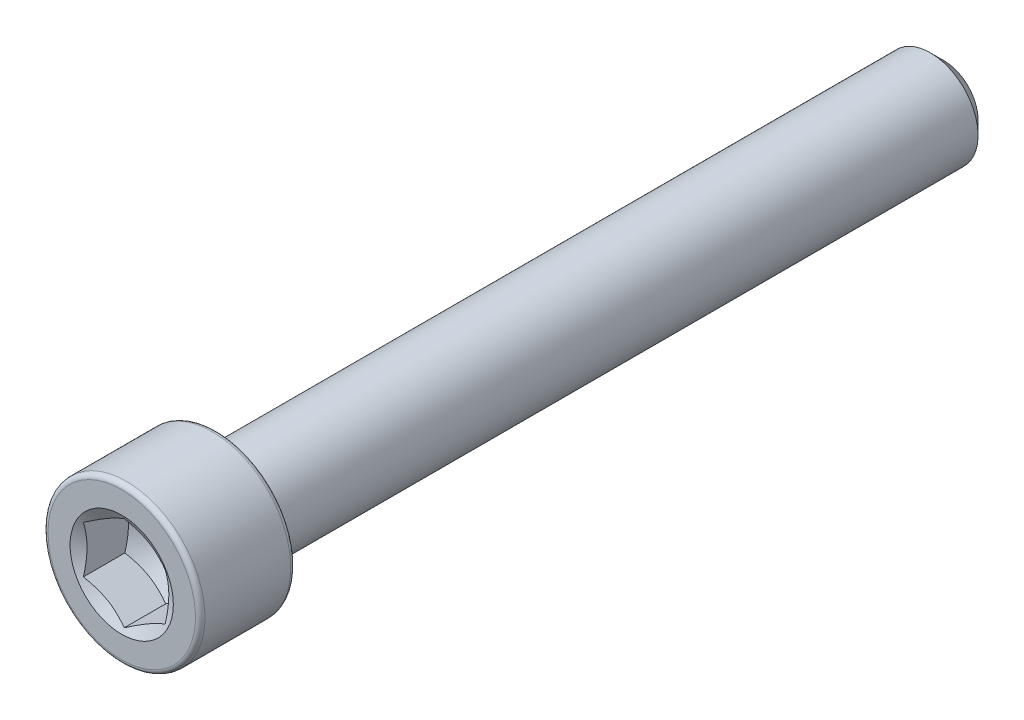
ISO-10303-21;
HEADER;
FILE_DESCRIPTION(('STEP AP214'),'2;1');
FILE_NAME('part.step','',(''),(''),'','','');
FILE_SCHEMA(('AUTOMOTIVE_DESIGN { 1 0 10303 214 1 1 1 1 }'));
ENDSEC;
DATA;
#1=APPLICATION_CONTEXT('core data for automotive mechanical design processes');
#2=APPLICATION_PROTOCOL_DEFINITION('international standard','automotive_design',2000,#1);
#3=PRODUCT_CONTEXT('',#1,'mechanical');
#4=PRODUCT('Part','Part','',(#3));
#5=PRODUCT_RELATED_PRODUCT_CATEGORY('part','',(#4));
#6=PRODUCT_DEFINITION_FORMATION('','',#4);
#7=PRODUCT_DEFINITION_CONTEXT('part definition',#1,'design');
#8=PRODUCT_DEFINITION('design','',#6,#7);
#9=PRODUCT_DEFINITION_SHAPE('','',#8);
#10=(LENGTH_UNIT() NAMED_UNIT(*) SI_UNIT(.MILLI.,.METRE.));
#11=(NAMED_UNIT(*) PLANE_ANGLE_UNIT() SI_UNIT($,.RADIAN.));
#12=(NAMED_UNIT(*) SI_UNIT($,.STERADIAN.) SOLID_ANGLE_UNIT());
#13=UNCERTAINTY_MEASURE_WITH_UNIT(LENGTH_MEASURE(1.E-05),#10,'distance_accuracy_value','');
#14=(GEOMETRIC_REPRESENTATION_CONTEXT(3) GLOBAL_UNCERTAINTY_ASSIGNED_CONTEXT((#13)) GLOBAL_UNIT_ASSIGNED_CONTEXT((#10,
#11,#12)) REPRESENTATION_CONTEXT('',''));
#15=CARTESIAN_POINT('',(0.,0.,0.));
#16=DIRECTION('',(0.,0.,1.));
#17=DIRECTION('',(1.,0.,0.));
#18=AXIS2_PLACEMENT_3D('',#15,#16,#17);
#19=CARTESIAN_POINT('',(0.,0.,-17.9578));
#20=DIRECTION('',(0.,0.,-1.));
#21=DIRECTION('',(-1.,0.,0.));
#22=AXIS2_PLACEMENT_3D('',#19,#20,#21);
#23=PLANE('',#22);
#24=CARTESIAN_POINT('',(0.,0.,-17.9578));
#25=DIRECTION('',(0.,0.,-1.));
#26=DIRECTION('',(-1.,0.,0.));
#27=AXIS2_PLACEMENT_3D('',#24,#25,#26);
#28=CIRCLE('',#27,1.48748750000003);
#29=CARTESIAN_POINT('',(-1.48748750000003,0.,-17.9578));
#30=VERTEX_POINT('',#29);
#31=EDGE_CURVE('E57',#30,#30,#28,.T.);
#32=ORIENTED_EDGE('',*,*,#31,.T.);
#33=EDGE_LOOP('',(#32));
#34=FACE_BOUND('',#33,.T.);
#35=ADVANCED_FACE('F43',(#34),#23,.T.);
#36=CARTESIAN_POINT('',(0.,0.,-17.9578));
#37=DIRECTION('',(0.,0.,1.));
#38=DIRECTION('',(1.,0.,0.));
#39=AXIS2_PLACEMENT_3D('',#36,#37,#38);
#40=CONICAL_SURFACE('',#39,1.48748750000003,0.785398163397443);
#41=CARTESIAN_POINT('',(0.,0.,-17.3624875));
#42=DIRECTION('',(0.,0.,-1.));
#43=DIRECTION('',(-1.,0.,0.));
#44=AXIS2_PLACEMENT_3D('',#41,#42,#43);
#45=CIRCLE('',#44,2.08280000000002);
#46=CARTESIAN_POINT('',(-2.08280000000002,0.,-17.3624875));
#47=VERTEX_POINT('',#46);
#48=EDGE_CURVE('E252',#47,#47,#45,.T.);
#49=ORIENTED_EDGE('',*,*,#48,.T.);
#50=EDGE_LOOP('',(#49));
#51=FACE_BOUND('',#50,.T.);
#52=ORIENTED_EDGE('',*,*,#31,.F.);
#53=EDGE_LOOP('',(#52));
#54=FACE_BOUND('',#53,.T.);
#55=ADVANCED_FACE('F241',(#51,#54),#40,.T.);
#56=CARTESIAN_POINT('',(0.,0.,-17.9578));
#57=DIRECTION('',(0.,0.,-1.));
#58=DIRECTION('',(-1.,0.,0.));
#59=AXIS2_PLACEMENT_3D('',#56,#57,#58);
#60=CYLINDRICAL_SURFACE('',#59,2.08280000000002);
#61=CARTESIAN_POINT('',(0.,0.,13.7922));
#62=DIRECTION('',(0.,0.,-1.));
#63=DIRECTION('',(-1.,0.,0.));
#64=AXIS2_PLACEMENT_3D('',#61,#62,#63);
#65=CIRCLE('',#64,2.08280000000002);
#66=CARTESIAN_POINT('',(-2.08280000000002,0.,13.7922));
#67=VERTEX_POINT('',#66);
#68=EDGE_CURVE('E255',#67,#67,#65,.T.);
#69=ORIENTED_EDGE('',*,*,#68,.T.);
#70=EDGE_LOOP('',(#69));
#71=FACE_BOUND('',#70,.T.);
#72=ORIENTED_EDGE('',*,*,#48,.F.);
#73=EDGE_LOOP('',(#72));
#74=FACE_BOUND('',#73,.T.);
#75=ADVANCED_FACE('F246',(#71,#74),#60,.T.);
#76=CARTESIAN_POINT('',(0.,2.08280000000001,13.7922));
#77=DIRECTION('',(0.,0.,-1.));
#78=DIRECTION('',(-1.,0.,0.));
#79=AXIS2_PLACEMENT_3D('',#76,#77,#78);
#80=PLANE('',#79);
#81=CARTESIAN_POINT('',(0.,0.,13.7922));
#82=DIRECTION('',(0.,0.,-1.));
#83=DIRECTION('',(-1.,0.,0.));
#84=AXIS2_PLACEMENT_3D('',#81,#82,#83);
#85=CIRCLE('',#84,3.22072);
#86=CARTESIAN_POINT('',(-3.22072,0.,13.7922));
#87=VERTEX_POINT('',#86);
#88=EDGE_CURVE('E261',#87,#87,#85,.T.);
#89=ORIENTED_EDGE('',*,*,#88,.T.);
#90=EDGE_LOOP('',(#89));
#91=FACE_BOUND('',#90,.T.);
#92=ORIENTED_EDGE('',*,*,#68,.F.);
#93=EDGE_LOOP('',(#92));
#94=FACE_BOUND('',#93,.T.);
#95=ADVANCED_FACE('F359',(#91,#94),#80,.T.);
#96=CARTESIAN_POINT('',(0.,0.,14.00048));
#97=DIRECTION('',(0.,0.,-1.));
#98=DIRECTION('',(-1.,0.,0.));
#99=AXIS2_PLACEMENT_3D('',#96,#97,#98);
#100=TOROIDAL_SURFACE('',#99,3.22072,0.208279999999999);
#101=CARTESIAN_POINT('',(0.,0.,14.00048));
#102=DIRECTION('',(0.,0.,-1.));
#103=DIRECTION('',(-1.,0.,0.));
#104=AXIS2_PLACEMENT_3D('',#101,#102,#103);
#105=CIRCLE('',#104,3.429);
#106=CARTESIAN_POINT('',(-3.429,0.,14.00048));
#107=VERTEX_POINT('',#106);
#108=EDGE_CURVE('E265',#107,#107,#105,.T.);
#109=ORIENTED_EDGE('',*,*,#108,.T.);
#110=EDGE_LOOP('',(#109));
#111=FACE_BOUND('',#110,.T.);
#112=ORIENTED_EDGE('',*,*,#88,.F.);
#113=EDGE_LOOP('',(#112));
#114=FACE_BOUND('',#113,.T.);
#115=ADVANCED_FACE('F352',(#111,#114),#100,.T.);
#116=CARTESIAN_POINT('',(0.,0.,-17.9578));
#117=DIRECTION('',(0.,0.,-1.));
#118=DIRECTION('',(-1.,0.,0.));
#119=AXIS2_PLACEMENT_3D('',#116,#117,#118);
#120=CYLINDRICAL_SURFACE('',#119,3.429);
#121=CARTESIAN_POINT('',(0.,0.,17.74952));
#122=DIRECTION('',(0.,0.,-1.));
#123=DIRECTION('',(-1.,0.,0.));
#124=AXIS2_PLACEMENT_3D('',#121,#122,#123);
#125=CIRCLE('',#124,3.429);
#126=CARTESIAN_POINT('',(-3.429,0.,17.74952));
#127=VERTEX_POINT('',#126);
#128=EDGE_CURVE('E268',#127,#127,#125,.T.);
#129=ORIENTED_EDGE('',*,*,#128,.T.);
#130=EDGE_LOOP('',(#129));
#131=FACE_BOUND('',#130,.T.);
#132=ORIENTED_EDGE('',*,*,#108,.F.);
#133=EDGE_LOOP('',(#132));
#134=FACE_BOUND('',#133,.T.);
#135=ADVANCED_FACE('F287',(#131,#134),#120,.T.);
#136=CARTESIAN_POINT('',(0.,0.,17.74952));
#137=DIRECTION('',(0.,0.,-1.));
#138=DIRECTION('',(-1.,0.,0.));
#139=AXIS2_PLACEMENT_3D('',#136,#137,#138);
#140=TOROIDAL_SURFACE('',#139,3.22072,0.208280000000003);
#141=CARTESIAN_POINT('',(0.,0.,17.9578));
#142=DIRECTION('',(0.,0.,-1.));
#143=DIRECTION('',(-1.,0.,0.));
#144=AXIS2_PLACEMENT_3D('',#141,#142,#143);
#145=CIRCLE('',#144,3.22072);
#146=CARTESIAN_POINT('',(-3.22072,0.,17.9578));
#147=VERTEX_POINT('',#146);
#148=EDGE_CURVE('E135',#147,#147,#145,.T.);
#149=ORIENTED_EDGE('',*,*,#148,.T.);
#150=EDGE_LOOP('',(#149));
#151=FACE_BOUND('',#150,.T.);
#152=ORIENTED_EDGE('',*,*,#128,.F.);
#153=EDGE_LOOP('',(#152));
#154=FACE_BOUND('',#153,.T.);
#155=ADVANCED_FACE('F277',(#151,#154),#140,.T.);
#156=CARTESIAN_POINT('',(0.,3.22071999999999,17.9578));
#157=DIRECTION('',(0.,0.,1.));
#158=DIRECTION('',(1.,0.,0.));
#159=AXIS2_PLACEMENT_3D('',#156,#157,#158);
#160=PLANE('',#159);
#161=CARTESIAN_POINT('',(0.,0.,17.9578));
#162=DIRECTION('',(0.,0.,1.));
#163=DIRECTION('',(1.,0.,0.));
#164=AXIS2_PLACEMENT_3D('',#161,#162,#163);
#165=CIRCLE('',#164,2.2553058273014);
#166=CARTESIAN_POINT('',(2.2553058273014,0.,17.9578));
#167=VERTEX_POINT('',#166);
#168=EDGE_CURVE('E290',#167,#167,#165,.T.);
#169=ORIENTED_EDGE('',*,*,#168,.F.);
#170=EDGE_LOOP('',(#169));
#171=FACE_BOUND('',#170,.T.);
#172=ORIENTED_EDGE('',*,*,#148,.F.);
#173=EDGE_LOOP('',(#172));
#174=FACE_BOUND('',#173,.T.);
#175=ADVANCED_FACE('F146',(#171,#174),#160,.T.);
#176=CARTESIAN_POINT('',(0.,0.,17.9578));
#177=DIRECTION('',(0.,0.,1.));
#178=DIRECTION('',(1.,0.,0.));
#179=AXIS2_PLACEMENT_3D('',#176,#177,#178);
#180=CONICAL_SURFACE('',#179,2.2553058273014,1.0471975511966);
#181=ORIENTED_EDGE('',*,*,#168,.T.);
#182=EDGE_LOOP('',(#181));
#183=FACE_BOUND('',#182,.T.);
#184=CARTESIAN_POINT('',(1.78613749999999,1.030996026327,17.8463902457682));
#185=CARTESIAN_POINT('',(1.70765298753213,1.07630908072754,17.8202168076921));
#186=CARTESIAN_POINT('',(1.62849100532971,1.12201327246169,17.7964125992998));
#187=CARTESIAN_POINT('',(1.46879612904911,1.2142131522705,17.7548611490479));
#188=CARTESIAN_POINT('',(1.38826039638754,1.26071047920204,17.7371286082323));
#189=CARTESIAN_POINT('',(1.22818707140352,1.35312885647164,17.7095240038494));
#190=CARTESIAN_POINT('',(1.14867411525882,1.39903568310585,17.699468239448));
#191=CARTESIAN_POINT('',(0.989273866724129,1.49106545950624,17.6874614604738));
#192=CARTESIAN_POINT('',(0.909387154117847,1.53718807453415,17.6855005056729));
#193=CARTESIAN_POINT('',(0.760101040798418,1.6233784522454,17.6895693606205));
#194=CARTESIAN_POINT('',(0.690679347730417,1.66345908542581,17.6946001252606));
#195=CARTESIAN_POINT('',(0.552288266102523,1.74335921365712,17.7105479939992));
#196=CARTESIAN_POINT('',(0.483319356586402,1.78317843213197,17.721470551437));
#197=CARTESIAN_POINT('',(0.344642695770659,1.86324343958425,17.7487773973743));
#198=CARTESIAN_POINT('',(0.27495250563971,1.90347908961623,17.7652774949854));
#199=CARTESIAN_POINT('',(0.13661183024592,1.98335011579471,17.8027267258336));
#200=CARTESIAN_POINT('',(0.0679595711845169,2.02298651604429,17.8236670537832));
#201=CARTESIAN_POINT('',(-0.000200000000001078,2.06233846281552,17.8463902457682));
#202=B_SPLINE_CURVE_WITH_KNOTS('',3,(#184,#185,#186,#187,#188,#189,#190,#191,#192,#193,#194,
#195,#196,#197,#198,#199,#200,#201),.UNSPECIFIED.,.F.,.F.,(4,2,2,2,2,2,2,2,4),(0.,
0.283101204842063,0.56688310088833,0.843640732082936,1.12005841039328,1.36078612471159,
1.60173703564045,1.84803423693753,2.0938475066861),.UNSPECIFIED.);
#203=CARTESIAN_POINT('',(1.78593749999999,1.03111149638084,17.8463235735026));
#204=VERTEX_POINT('',#203);
#205=CARTESIAN_POINT('',(0.,2.06222299276168,17.8463235735026));
#206=VERTEX_POINT('',#205);
#207=EDGE_CURVE('E115',#204,#206,#202,.T.);
#208=ORIENTED_EDGE('',*,*,#207,.F.);
#209=CARTESIAN_POINT('',(1.78593749999999,-2.69758264771828,18.5235426868391));
#210=CARTESIAN_POINT('',(1.78593749999999,-2.62012259041519,18.4862636843077));
#211=CARTESIAN_POINT('',(1.78593749999999,-2.54247668483849,18.4493637946794));
#212=CARTESIAN_POINT('',(1.78593749999999,-2.38671397459031,18.3765371845213));
#213=CARTESIAN_POINT('',(1.78593749999999,-2.30859709065796,18.3406106337188));
#214=CARTESIAN_POINT('',(1.78593749999999,-2.15135521009003,18.2697492558914));
#215=CARTESIAN_POINT('',(1.78593749999999,-2.07222698237029,18.2348215722438));
#216=CARTESIAN_POINT('',(1.78593749999999,-1.91331493598689,18.1664965769099));
#217=CARTESIAN_POINT('',(1.78593749999999,-1.83353115094794,18.1330991873029));
#218=CARTESIAN_POINT('',(1.78593749999999,-1.67096618357135,18.0673456687277));
#219=CARTESIAN_POINT('',(1.78593749999999,-1.58816300038914,18.0350436191632));
#220=CARTESIAN_POINT('',(1.78593749999999,-1.42156112656087,17.9730632721621));
#221=CARTESIAN_POINT('',(1.78593749999999,-1.33776231333349,17.9433853016785));
#222=CARTESIAN_POINT('',(1.78593749999999,-1.1692220220391,17.8874867539738));
#223=CARTESIAN_POINT('',(1.78593749999999,-1.084483165363,17.8612583568392));
#224=CARTESIAN_POINT('',(1.78593749999999,-0.913786163547337,17.8131433270575));
#225=CARTESIAN_POINT('',(1.78593749999999,-0.827828324781463,17.7912556234588));
#226=CARTESIAN_POINT('',(1.78593749999999,-0.655084549884429,17.7530261588678));
#227=CARTESIAN_POINT('',(1.78593749999999,-0.568304335338395,17.7366590421217));
#228=CARTESIAN_POINT('',(1.78593749999999,-0.393746048068966,17.7104528135952));
#229=CARTESIAN_POINT('',(1.78593749999999,-0.305968052538008,17.7006132002697));
#230=CARTESIAN_POINT('',(1.78593749999999,-0.130962716485576,17.6883785557359));
#231=CARTESIAN_POINT('',(1.78593749999999,-0.0437418469765707,17.6858936055758));
#232=CARTESIAN_POINT('',(1.78593749999999,0.130592934900126,17.688336070232));
#233=CARTESIAN_POINT('',(1.78593749999999,0.217706841000561,17.693263900411));
#234=CARTESIAN_POINT('',(1.78593749999999,0.431120733446831,17.7139821974728));
#235=CARTESIAN_POINT('',(1.78593749999999,0.557038517233457,17.7337228004352));
#236=CARTESIAN_POINT('',(1.78593749999999,0.806440222774731,17.7850381632509));
#237=CARTESIAN_POINT('',(1.78593749999999,0.929921492877504,17.8166251403235));
#238=CARTESIAN_POINT('',(1.78593749999999,1.1771275779522,17.8890666470735));
#239=CARTESIAN_POINT('',(1.78593749999999,1.30079401125151,17.9301156843391));
#240=CARTESIAN_POINT('',(1.78593749999999,1.48458504652945,17.9962570287602));
#241=CARTESIAN_POINT('',(1.78593749999999,1.54555601200979,18.0190621265715));
#242=CARTESIAN_POINT('',(1.78593749999999,1.66700448583618,18.0659509496154));
#243=CARTESIAN_POINT('',(1.78593749999999,1.72748200297302,18.0900346520121));
#244=CARTESIAN_POINT('',(1.78593749999999,1.88424149051046,18.1540616553898));
#245=CARTESIAN_POINT('',(1.78593749999999,1.98018443802618,18.1948329191166));
#246=CARTESIAN_POINT('',(1.78593749999999,2.17117609670512,18.2784247196407));
#247=CARTESIAN_POINT('',(1.78593749999999,2.26622473668082,18.3212454179505));
#248=CARTESIAN_POINT('',(1.78593749999999,2.55034675834729,18.4520525004115));
#249=CARTESIAN_POINT('',(1.78593749999999,2.73834755541704,18.5423633596409));
#250=CARTESIAN_POINT('',(1.78593749999999,3.11271398702262,18.7268619991649));
#251=CARTESIAN_POINT('',(1.78593749999999,3.29907721105925,18.8210546102587));
#252=CARTESIAN_POINT('',(1.78593749999999,3.67050227471046,19.0118957072539));
#253=CARTESIAN_POINT('',(1.78593749999999,3.85556431392613,19.1085438055063));
#254=CARTESIAN_POINT('',(1.78593749999999,4.20682233829504,19.29403234663));
#255=CARTESIAN_POINT('',(1.78593749999999,4.37310096820637,19.382716846137));
#256=CARTESIAN_POINT('',(1.78593749999999,4.7051230548909,19.5610996279771));
#257=CARTESIAN_POINT('',(1.78593749999999,4.87086648642207,19.6507979572539));
#258=CARTESIAN_POINT('',(1.78593749999999,5.20149434658739,19.8307084214208));
#259=CARTESIAN_POINT('',(1.78593749999999,5.36637988633187,19.920918517152));
#260=CARTESIAN_POINT('',(1.78593749999999,5.69581647813696,20.1019235664943));
#261=CARTESIAN_POINT('',(1.78593749999999,5.86036755026333,20.1927184835707));
#262=CARTESIAN_POINT('',(1.78593749999999,6.02479942172327,20.2837274610164));
#263=B_SPLINE_CURVE_WITH_KNOTS('',3,(#209,#210,#211,#212,#213,#214,#215,#216,#217,#218,#219,
#220,#221,#222,#223,#224,#225,#226,#227,#228,#229,#230,#231,#232,#233,#234,#235,#236,#237,#238,
#239,#240,#241,#242,#243,#244,#245,#246,#247,#248,#249,#250,#251,#252,#253,#254,#255,#256,#257,
#258,#259,#260,#261,#262),.UNSPECIFIED.,.F.,.F.,(4,2,2,2,2,2,2,2,2,2,2,2,2,2,2,2,2,2,2,2,2,2,2,
2,2,2,4),(0.,0.257895100869512,0.515834886822402,0.775304092310052,1.03476007121657,
1.30136802092372,1.56800914256977,1.83403498977158,2.09999512023696,2.36471652541159,
2.62941758818123,2.89086873629833,3.15233453493419,3.53391158235072,3.91588323889407,
4.30654567753013,4.50182529543225,4.69710142679917,5.00980707595597,5.3225374096282,
5.94815647890531,6.57457913899202,7.20090351250651,7.76625052018438,8.33162381337449,
8.89547174137727,9.45928478023966),.UNSPECIFIED.);
#264=CARTESIAN_POINT('',(1.78593749999999,-1.03111149638084,17.8463235735026));
#265=VERTEX_POINT('',#264);
#266=EDGE_CURVE('E202',#265,#204,#263,.T.);
#267=ORIENTED_EDGE('',*,*,#266,.F.);
#268=CARTESIAN_POINT('',(-0.000200000000002484,-2.06233846281552,17.8463902457682));
#269=CARTESIAN_POINT('',(0.0782845124678554,-2.01702540841499,17.8202168076921));
#270=CARTESIAN_POINT('',(0.157446494670273,-1.97132121668084,17.7964125992998));
#271=CARTESIAN_POINT('',(0.317141370950875,-1.87912133687203,17.7548611490479));
#272=CARTESIAN_POINT('',(0.397677103612452,-1.83262400994048,17.7371286082323));
#273=CARTESIAN_POINT('',(0.557750428596469,-1.74020563267088,17.7095240038494));
#274=CARTESIAN_POINT('',(0.637263384741167,-1.69429880603668,17.699468239448));
#275=CARTESIAN_POINT('',(0.796663633275858,-1.60226902963628,17.6874614604738));
#276=CARTESIAN_POINT('',(0.876550345882141,-1.55614641460837,17.6855005056729));
#277=CARTESIAN_POINT('',(1.02583645920157,-1.46995603689712,17.6895693606205));
#278=CARTESIAN_POINT('',(1.09525815226957,-1.42987540371671,17.6946001252606));
#279=CARTESIAN_POINT('',(1.23364923389746,-1.34997527548541,17.7105479939992));
#280=CARTESIAN_POINT('',(1.30261814341359,-1.31015605701056,17.721470551437));
#281=CARTESIAN_POINT('',(1.44129480422933,-1.23009104955827,17.7487773973743));
#282=CARTESIAN_POINT('',(1.51098499436028,-1.18985539952629,17.7652774949854));
#283=CARTESIAN_POINT('',(1.64932566975407,-1.10998437334781,17.8027267258336));
#284=CARTESIAN_POINT('',(1.71797792881547,-1.07034797309823,17.8236670537832));
#285=CARTESIAN_POINT('',(1.78613749999999,-1.030996026327,17.8463902457682));
#286=B_SPLINE_CURVE_WITH_KNOTS('',3,(#268,#269,#270,#271,#272,#273,#274,#275,#276,#277,#278,
#279,#280,#281,#282,#283,#284,#285),.UNSPECIFIED.,.F.,.F.,(4,2,2,2,2,2,2,2,4),(0.,
0.283101204842065,0.566883100888332,0.843640732082938,1.12005841039328,1.3607861247116,
1.60173703564045,1.84803423693753,2.0938475066861),.UNSPECIFIED.);
#287=CARTESIAN_POINT('',(0.,-2.06222299276168,17.8463235735026));
#288=VERTEX_POINT('',#287);
#289=EDGE_CURVE('E214',#288,#265,#286,.T.);
#290=ORIENTED_EDGE('',*,*,#289,.F.);
#291=CARTESIAN_POINT('',(-1.78613749999999,-1.030996026327,17.8463902457682));
#292=CARTESIAN_POINT('',(-1.70765298753213,-1.07630908072754,17.8202168076921));
#293=CARTESIAN_POINT('',(-1.62849100532971,-1.12201327246169,17.7964125992998));
#294=CARTESIAN_POINT('',(-1.46879612904911,-1.2142131522705,17.7548611490479));
#295=CARTESIAN_POINT('',(-1.38826039638753,-1.26071047920204,17.7371286082323));
#296=CARTESIAN_POINT('',(-1.22818707140352,-1.35312885647165,17.7095240038494));
#297=CARTESIAN_POINT('',(-1.14867411525882,-1.39903568310585,17.699468239448));
#298=CARTESIAN_POINT('',(-0.989273866724128,-1.49106545950625,17.6874614604738));
#299=CARTESIAN_POINT('',(-0.909387154117845,-1.53718807453416,17.6855005056729));
#300=CARTESIAN_POINT('',(-0.760101040798416,-1.6233784522454,17.6895693606205));
#301=CARTESIAN_POINT('',(-0.690679347730416,-1.66345908542581,17.6946001252606));
#302=CARTESIAN_POINT('',(-0.552288266102523,-1.74335921365712,17.7105479939992));
#303=CARTESIAN_POINT('',(-0.483319356586402,-1.78317843213197,17.7214705514371));
#304=CARTESIAN_POINT('',(-0.34464269577066,-1.86324343958425,17.7487773973743));
#305=CARTESIAN_POINT('',(-0.274952505639711,-1.90347908961623,17.7652774949854));
#306=CARTESIAN_POINT('',(-0.136611830245921,-1.98335011579471,17.8027267258336));
#307=CARTESIAN_POINT('',(-0.067959571184519,-2.02298651604429,17.8236670537832));
#308=CARTESIAN_POINT('',(0.000199999999998103,-2.06233846281552,17.8463902457682));
#309=B_SPLINE_CURVE_WITH_KNOTS('',3,(#291,#292,#293,#294,#295,#296,#297,#298,#299,#300,#301,
#302,#303,#304,#305,#306,#307,#308),.UNSPECIFIED.,.F.,.F.,(4,2,2,2,2,2,2,2,4),(0.,
0.283101204842065,0.566883100888333,0.843640732082938,1.12005841039329,1.3607861247116,
1.60173703564045,1.84803423693753,2.0938475066861),.UNSPECIFIED.);
#310=CARTESIAN_POINT('',(-1.78593749999999,-1.03111149638084,17.8463235735026));
#311=VERTEX_POINT('',#310);
#312=EDGE_CURVE('E64',#311,#288,#309,.T.);
#313=ORIENTED_EDGE('',*,*,#312,.F.);
#314=CARTESIAN_POINT('',(-1.78593749999999,-2.69758264785988,18.5235426869072));
#315=CARTESIAN_POINT('',(-1.78593749999999,-2.62012259055204,18.486263684373));
#316=CARTESIAN_POINT('',(-1.78593749999999,-2.54247668497059,18.4493637947418));
#317=CARTESIAN_POINT('',(-1.78593749999999,-2.38671397471288,18.3765371845779));
#318=CARTESIAN_POINT('',(-1.78593749999999,-2.30859709077576,18.3406106337726));
#319=CARTESIAN_POINT('',(-1.78593749999999,-2.15135521019821,18.2697492559394));
#320=CARTESIAN_POINT('',(-1.78593749999999,-2.07222698247362,18.234821572289));
#321=CARTESIAN_POINT('',(-1.78593749999999,-1.91331493608047,18.1664965769494));
#322=CARTESIAN_POINT('',(-1.78593749999999,-1.83353115103663,18.1330991873395));
#323=CARTESIAN_POINT('',(-1.78593749999999,-1.67096618364998,18.0673456687587));
#324=CARTESIAN_POINT('',(-1.78593749999999,-1.58816300046259,18.0350436191914));
#325=CARTESIAN_POINT('',(-1.78593749999999,-1.42156112662388,17.9730632721847));
#326=CARTESIAN_POINT('',(-1.78593749999999,-1.33776231339123,17.9433853016984));
#327=CARTESIAN_POINT('',(-1.78593749999999,-1.16922202208622,17.8874867539887));
#328=CARTESIAN_POINT('',(-1.78593749999999,-1.08448316540475,17.8612583568517));
#329=CARTESIAN_POINT('',(-1.78593749999999,-0.913786163578209,17.8131433270655));
#330=CARTESIAN_POINT('',(-1.78593749999999,-0.82782832480682,17.7912556234648));
#331=CARTESIAN_POINT('',(-1.78593749999999,-0.655084549895724,17.7530261588699));
#332=CARTESIAN_POINT('',(-1.78593749999999,-0.568304335341104,17.7366590421219));
#333=CARTESIAN_POINT('',(-1.78593749999999,-0.393746048054319,17.7104528135931));
#334=CARTESIAN_POINT('',(-1.78593749999999,-0.305968052514591,17.7006132002672));
#335=CARTESIAN_POINT('',(-1.78593749999999,-0.130962716444772,17.6883785557339));
#336=CARTESIAN_POINT('',(-1.78593749999999,-0.0437418469271504,17.6858936055749));
#337=CARTESIAN_POINT('',(-1.78593749999999,0.130592934966621,17.6883360702346));
#338=CARTESIAN_POINT('',(-1.78593749999999,0.217706841075515,17.693263900416));
#339=CARTESIAN_POINT('',(-1.78593749999999,0.431120733535379,17.7139821974846));
#340=CARTESIAN_POINT('',(-1.78593749999999,0.557038517327045,17.7337228004512));
#341=CARTESIAN_POINT('',(-1.78593749999999,0.806440222878063,17.7850381632754));
#342=CARTESIAN_POINT('',(-1.78593749999999,0.92992149298554,17.8166251403524));
#343=CARTESIAN_POINT('',(-1.78593749999999,1.1771275780697,17.8890666471109));
#344=CARTESIAN_POINT('',(-1.78593749999999,1.30079401137375,17.9301156843806));
#345=CARTESIAN_POINT('',(-1.78593749999999,1.4845850466588,17.9962570288079));
#346=CARTESIAN_POINT('',(-1.78593749999999,1.54555601214149,18.0190621266212));
#347=CARTESIAN_POINT('',(-1.78593749999999,1.66700448597261,18.0659509496691));
#348=CARTESIAN_POINT('',(-1.78593749999999,1.7274820031118,18.0900346520678));
#349=CARTESIAN_POINT('',(-1.78593749999999,1.88424149065075,18.1540616554487));
#350=CARTESIAN_POINT('',(-1.78593749999999,1.98018443816569,18.1948329191765));
#351=CARTESIAN_POINT('',(-1.78593749999999,2.17117609684315,18.2784247197023));
#352=CARTESIAN_POINT('',(-1.78593749999999,2.26622473681816,18.3212454180128));
#353=CARTESIAN_POINT('',(-1.78593749999999,2.55034675848266,18.4520525004756));
#354=CARTESIAN_POINT('',(-1.78593749999999,2.73834755555126,18.5423633597059));
#355=CARTESIAN_POINT('',(-1.78593749999999,3.11271398715466,18.7268619992311));
#356=CARTESIAN_POINT('',(-1.78593749999999,3.29907721119027,18.8210546103253));
#357=CARTESIAN_POINT('',(-1.78593749999999,3.67050227483957,19.0118957073209));
#358=CARTESIAN_POINT('',(-1.78593749999999,3.85556431405435,19.1085438055735));
#359=CARTESIAN_POINT('',(-1.78593749999999,4.20682233842245,19.2940323466977));
#360=CARTESIAN_POINT('',(-1.78593749999999,4.37310096833385,19.3827168462052));
#361=CARTESIAN_POINT('',(-1.78593749999999,4.70512305501857,19.5610996280461));
#362=CARTESIAN_POINT('',(-1.78593749999999,4.87086648654985,19.6507979573232));
#363=CARTESIAN_POINT('',(-1.78593749999999,5.20149434671552,19.8307084214908));
#364=CARTESIAN_POINT('',(-1.78593749999999,5.36637988646023,19.9209185172224));
#365=CARTESIAN_POINT('',(-1.78593749999999,5.69581647826582,20.1019235665653));
#366=CARTESIAN_POINT('',(-1.78593749999999,5.86036755039245,20.192718483642));
#367=CARTESIAN_POINT('',(-1.78593749999999,6.02479942185266,20.283727461088));
#368=B_SPLINE_CURVE_WITH_KNOTS('',3,(#314,#315,#316,#317,#318,#319,#320,#321,#322,#323,#324,
#325,#326,#327,#328,#329,#330,#331,#332,#333,#334,#335,#336,#337,#338,#339,#340,#341,#342,#343,
#344,#345,#346,#347,#348,#349,#350,#351,#352,#353,#354,#355,#356,#357,#358,#359,#360,#361,#362,
#363,#364,#365,#366,#367),.UNSPECIFIED.,.F.,.F.,(4,2,2,2,2,2,2,2,2,2,2,2,2,2,2,2,2,2,2,2,2,2,2,
2,2,2,4),(0.,0.257895100886104,0.51583488685559,0.775304092360041,1.03476007128336,
1.30136802100807,1.5680091426717,1.83403498989101,2.09999512037388,2.36471652557476,
2.62941758837063,2.89086873651338,3.15233453517491,3.5339115826083,3.91588323916855,
4.30654567782215,4.50182529573303,4.69710142710871,5.00980707626452,5.32253740993575,
5.94815647921083,6.57457913929533,7.20090351280763,7.76625052048629,8.33162381367719,
8.8954717416811,9.45928478054463),.UNSPECIFIED.);
#369=CARTESIAN_POINT('',(-1.78593749999999,1.03111149638084,17.8463235735026));
#370=VERTEX_POINT('',#369);
#371=EDGE_CURVE('E11',#370,#311,#368,.F.);
#372=ORIENTED_EDGE('',*,*,#371,.F.);
#373=CARTESIAN_POINT('',(0.000199999999998483,2.06233846281552,17.8463902457682));
#374=CARTESIAN_POINT('',(-0.0782845124678594,2.01702540841498,17.8202168076921));
#375=CARTESIAN_POINT('',(-0.157446494670277,1.97132121668083,17.7964125992998));
#376=CARTESIAN_POINT('',(-0.317141370950878,1.87912133687203,17.7548611490479));
#377=CARTESIAN_POINT('',(-0.397677103612455,1.83262400994048,17.7371286082323));
#378=CARTESIAN_POINT('',(-0.557750428596472,1.74020563267088,17.7095240038494));
#379=CARTESIAN_POINT('',(-0.63726338474117,1.69429880603668,17.699468239448));
#380=CARTESIAN_POINT('',(-0.79666363327586,1.60226902963628,17.6874614604738));
#381=CARTESIAN_POINT('',(-0.876550345882143,1.55614641460837,17.6855005056729));
#382=CARTESIAN_POINT('',(-1.02583645920157,1.46995603689712,17.6895693606205));
#383=CARTESIAN_POINT('',(-1.09525815226957,1.42987540371671,17.6946001252606));
#384=CARTESIAN_POINT('',(-1.23364923389747,1.3499752754854,17.7105479939992));
#385=CARTESIAN_POINT('',(-1.30261814341359,1.31015605701056,17.7214705514371));
#386=CARTESIAN_POINT('',(-1.44129480422933,1.23009104955827,17.7487773973743));
#387=CARTESIAN_POINT('',(-1.51098499436028,1.18985539952629,17.7652774949854));
#388=CARTESIAN_POINT('',(-1.64932566975407,1.10998437334781,17.8027267258336));
#389=CARTESIAN_POINT('',(-1.71797792881547,1.07034797309823,17.8236670537832));
#390=CARTESIAN_POINT('',(-1.78613749999999,1.030996026327,17.8463902457682));
#391=B_SPLINE_CURVE_WITH_KNOTS('',3,(#373,#374,#375,#376,#377,#378,#379,#380,#381,#382,#383,
#384,#385,#386,#387,#388,#389,#390),.UNSPECIFIED.,.F.,.F.,(4,2,2,2,2,2,2,2,4),(0.,
0.283101204842063,0.56688310088833,0.843640732082935,1.12005841039328,1.36078612471159,
1.60173703564045,1.84803423693753,2.0938475066861),.UNSPECIFIED.);
#392=EDGE_CURVE('E100',#206,#370,#391,.T.);
#393=ORIENTED_EDGE('',*,*,#392,.F.);
#394=EDGE_LOOP('',(#208,#267,#290,#313,#372,#393));
#395=FACE_BOUND('',#394,.T.);
#396=ADVANCED_FACE('F99',(#183,#395),#180,.F.);
#397=CARTESIAN_POINT('',(0.,0.,15.875));
#398=DIRECTION('',(0.,0.,1.));
#399=DIRECTION('',(1.,0.,0.));
#400=AXIS2_PLACEMENT_3D('',#397,#398,#399);
#401=CONICAL_SURFACE('',#400,1.7859375,1.0471975511966);
#402=CARTESIAN_POINT('',(0.,0.,14.8438885036192));
#403=VERTEX_POINT('',#402);
#404=VERTEX_LOOP('',#403);
#405=FACE_BOUND('',#404,.T.);
#406=CARTESIAN_POINT('',(1.78613749999999,-1.030996026327,16.0345801758848));
#407=CARTESIAN_POINT('',(1.70765298753213,-1.07630908072754,16.0084067378086));
#408=CARTESIAN_POINT('',(1.62849100532971,-1.12201327246169,15.9846025294163));
#409=CARTESIAN_POINT('',(1.46879612904911,-1.2142131522705,15.9430510791645));
#410=CARTESIAN_POINT('',(1.38826039638754,-1.26071047920204,15.9253185383489));
#411=CARTESIAN_POINT('',(1.22818707140352,-1.35312885647164,15.897713933966));
#412=CARTESIAN_POINT('',(1.14867411525882,-1.39903568310585,15.8876581695645));
#413=CARTESIAN_POINT('',(0.98927386672413,-1.49106545950624,15.8756513905903));
#414=CARTESIAN_POINT('',(0.909387154117848,-1.53718807453416,15.8736904357894));
#415=CARTESIAN_POINT('',(0.760101040798418,-1.6233784522454,15.877759290737));
#416=CARTESIAN_POINT('',(0.690679347730418,-1.66345908542581,15.8827900553772));
#417=CARTESIAN_POINT('',(0.552288266102524,-1.74335921365712,15.8987379241157));
#418=CARTESIAN_POINT('',(0.483319356586402,-1.78317843213197,15.9096604815536));
#419=CARTESIAN_POINT('',(0.34464269577066,-1.86324343958425,15.9369673274909));
#420=CARTESIAN_POINT('',(0.27495250563971,-1.90347908961623,15.9534674251019));
#421=CARTESIAN_POINT('',(0.136611830245919,-1.98335011579471,15.9909166559501));
#422=CARTESIAN_POINT('',(0.0679595711845166,-2.02298651604429,16.0118569838998));
#423=CARTESIAN_POINT('',(-0.000200000000001566,-2.06233846281552,16.0345801758848));
#424=B_SPLINE_CURVE_WITH_KNOTS('',3,(#406,#407,#408,#409,#410,#411,#412,#413,#414,#415,#416,
#417,#418,#419,#420,#421,#422,#423),.UNSPECIFIED.,.F.,.F.,(4,2,2,2,2,2,2,2,4),(0.,
0.283101204842064,0.56688310088833,0.843640732082935,1.12005841039328,1.36078612471159,
1.60173703564045,1.84803423693753,2.0938475066861),.UNSPECIFIED.);
#425=CARTESIAN_POINT('',(1.78593749999999,-1.03111149638084,16.0345135036191));
#426=VERTEX_POINT('',#425);
#427=CARTESIAN_POINT('',(0.,-2.06222299276168,16.0345135036191));
#428=VERTEX_POINT('',#427);
#429=EDGE_CURVE('E161',#426,#428,#424,.T.);
#430=ORIENTED_EDGE('',*,*,#429,.F.);
#431=CARTESIAN_POINT('',(1.78593749999999,-2.75046117787843,16.7372637477201));
#432=CARTESIAN_POINT('',(1.78593749999999,-2.67254709166387,16.6995462698515));
#433=CARTESIAN_POINT('',(1.78593749999999,-2.59445191257798,16.6621963509879));
#434=CARTESIAN_POINT('',(1.78593749999999,-2.43780284473195,16.5884390099748));
#435=CARTESIAN_POINT('',(1.78593749999999,-2.35924888393686,16.5520317409912));
#436=CARTESIAN_POINT('',(1.78593749999999,-2.20117250074203,16.4801801570941));
#437=CARTESIAN_POINT('',(1.78593749999999,-2.12164712195782,16.4447423234687));
#438=CARTESIAN_POINT('',(1.78593749999999,-1.96195621580744,16.3753451853954));
#439=CARTESIAN_POINT('',(1.78593749999999,-1.88179071968034,16.3413858093113));
#440=CARTESIAN_POINT('',(1.78593749999999,-1.71832547591583,16.2743668781749));
#441=CARTESIAN_POINT('',(1.78593749999999,-1.6350027862552,16.241362971318));
#442=CARTESIAN_POINT('',(1.78593749999999,-1.46737533832862,16.1778996538501));
#443=CARTESIAN_POINT('',(1.78593749999999,-1.38307046288678,16.1474405504536));
#444=CARTESIAN_POINT('',(1.78593749999999,-1.21351233823061,16.0898810721163));
#445=CARTESIAN_POINT('',(1.78593749999999,-1.12826151531903,16.0627736226172));
#446=CARTESIAN_POINT('',(1.78593749999999,-0.956531316986428,16.0127954028685));
#447=CARTESIAN_POINT('',(1.78593749999999,-0.870052238474813,15.9899236268733));
#448=CARTESIAN_POINT('',(1.78593749999999,-0.696231710455857,15.9496331361939));
#449=CARTESIAN_POINT('',(1.78593749999999,-0.608896113632918,15.9321896450319));
#450=CARTESIAN_POINT('',(1.78593749999999,-0.433161726131875,15.9037785044821));
#451=CARTESIAN_POINT('',(1.78593749999999,-0.344763051926587,15.8928101521435));
#452=CARTESIAN_POINT('',(1.78593749999999,-0.168479109252376,15.8783700744848));
#453=CARTESIAN_POINT('',(1.78593749999999,-0.0806017917027538,15.8748040276059));
#454=CARTESIAN_POINT('',(1.78593749999999,0.0951365653458899,15.875213045968));
#455=CARTESIAN_POINT('',(1.78593749999999,0.18299760322504,15.8791886521781));
#456=CARTESIAN_POINT('',(1.78593749999999,0.394746762863015,15.8975107826194));
#457=CARTESIAN_POINT('',(1.78593749999999,0.5183204475722,15.9155019136301));
#458=CARTESIAN_POINT('',(1.78593749999999,0.763185360842695,15.963207006964));
#459=CARTESIAN_POINT('',(1.78593749999999,0.884474429273977,15.992931532444));
#460=CARTESIAN_POINT('',(1.78593749999999,1.0660452879175,16.0443274104062));
#461=CARTESIAN_POINT('',(1.78593749999999,1.1272505742157,16.0628632268523));
#462=CARTESIAN_POINT('',(1.78593749999999,1.24906176271801,16.1018171789896));
#463=CARTESIAN_POINT('',(1.78593749999999,1.30966765981721,16.1222353306972));
#464=CARTESIAN_POINT('',(1.78593749999999,1.4303093727868,16.1646290263115));
#465=CARTESIAN_POINT('',(1.78593749999999,1.49034534153027,16.1866041383919));
#466=CARTESIAN_POINT('',(1.78593749999999,1.60991879472435,16.231858297325));
#467=CARTESIAN_POINT('',(1.78593749999999,1.66945630221638,16.2551372835192));
#468=CARTESIAN_POINT('',(1.78593749999999,1.88097039043347,16.3400597973185));
#469=CARTESIAN_POINT('',(1.78593749999999,2.03173950033884,16.4047085683762));
#470=CARTESIAN_POINT('',(1.78593749999999,2.33126548092368,16.5385306950584));
#471=CARTESIAN_POINT('',(1.78593749999999,2.4800218256194,16.6077052068242));
#472=CARTESIAN_POINT('',(1.78593749999999,2.77618412955939,16.7491312652801));
#473=CARTESIAN_POINT('',(1.78593749999999,2.92358909670721,16.8213848820646));
#474=CARTESIAN_POINT('',(1.78593749999999,3.21735068684024,16.9679947567006));
#475=CARTESIAN_POINT('',(1.78593749999999,3.36370727310197,17.0423510877605));
#476=CARTESIAN_POINT('',(1.78593749999999,3.65599226435768,17.1927501365525));
#477=CARTESIAN_POINT('',(1.78593749999999,3.80191880984678,17.2687964601928));
#478=CARTESIAN_POINT('',(1.78593749999999,4.0931847725688,17.4220113482571));
#479=CARTESIAN_POINT('',(1.78593749999999,4.23852417584449,17.4991799391607));
#480=CARTESIAN_POINT('',(1.78593749999999,4.67374474311707,17.7318728631804));
#481=CARTESIAN_POINT('',(1.78593749999999,4.96295532469398,17.8886504091202));
#482=CARTESIAN_POINT('',(1.78593749999999,5.49489838795205,18.17942798059));
#483=CARTESIAN_POINT('',(1.78593749999999,5.73779165627401,18.3131351789152));
#484=CARTESIAN_POINT('',(1.78593749999999,6.22304727723742,18.581581978946));
#485=CARTESIAN_POINT('',(1.78593749999999,6.46540955856531,18.716321709559));
#486=CARTESIAN_POINT('',(1.78593749999999,6.94869484694708,18.9859523289733));
#487=CARTESIAN_POINT('',(1.78593749999999,7.18961958357684,19.1208401215085));
#488=CARTESIAN_POINT('',(1.78593749999999,7.67112741466904,19.3911477538053));
#489=CARTESIAN_POINT('',(1.78593749999999,7.91171055112464,19.5265675187425));
#490=CARTESIAN_POINT('',(1.78593749999999,8.15218624534727,19.6621770425348));
#491=B_SPLINE_CURVE_WITH_KNOTS('',3,(#431,#432,#433,#434,#435,#436,#437,#438,#439,#440,#441,
#442,#443,#444,#445,#446,#447,#448,#449,#450,#451,#452,#453,#454,#455,#456,#457,#458,#459,#460,
#461,#462,#463,#464,#465,#466,#467,#468,#469,#470,#471,#472,#473,#474,#475,#476,#477,#478,#479,
#480,#481,#482,#483,#484,#485,#486,#487,#488,#489,#490),.UNSPECIFIED.,.F.,.F.,(4,2,2,2,2,2,2,2,
2,2,2,2,2,2,2,2,2,2,2,2,2,2,2,2,2,2,2,2,2,4),(0.,0.259693321731059,0.519428578088267,
0.78060830115291,1.0417753550669,1.31060631491154,1.57946968188365,1.84775548494629,
2.11597750258537,2.3829566746231,2.64990685767432,2.91343409283102,3.17698023172522,
3.55084565835108,3.92504843313922,4.11687673883051,4.30870667689545,4.5004836172156,
4.69225164313786,5.18424658771359,5.67636771132541,6.16882507720109,6.66129960970911,
7.15495122105958,7.6486144989747,8.63551146314867,9.46729831399256,10.2991907591362,
11.1275347798057,11.9557661877857),.UNSPECIFIED.);
#492=CARTESIAN_POINT('',(1.78593749999999,1.03111149638084,16.0345135036191));
#493=VERTEX_POINT('',#492);
#494=EDGE_CURVE('E168',#493,#426,#491,.F.);
#495=ORIENTED_EDGE('',*,*,#494,.F.);
#496=CARTESIAN_POINT('',(-0.000200000000001231,2.06233846281552,16.0345801758848));
#497=CARTESIAN_POINT('',(0.0782845124678573,2.01702540841499,16.0084067378086));
#498=CARTESIAN_POINT('',(0.157446494670275,1.97132121668083,15.9846025294163));
#499=CARTESIAN_POINT('',(0.317141370950878,1.87912133687202,15.9430510791645));
#500=CARTESIAN_POINT('',(0.397677103612455,1.83262400994048,15.9253185383489));
#501=CARTESIAN_POINT('',(0.557750428596473,1.74020563267088,15.897713933966));
#502=CARTESIAN_POINT('',(0.637263384741172,1.69429880603667,15.8876581695645));
#503=CARTESIAN_POINT('',(0.796663633275864,1.60226902963628,15.8756513905903));
#504=CARTESIAN_POINT('',(0.876550345882147,1.55614641460836,15.8736904357894));
#505=CARTESIAN_POINT('',(1.02583645920158,1.46995603689712,15.8777592907371));
#506=CARTESIAN_POINT('',(1.09525815226958,1.42987540371671,15.8827900553772));
#507=CARTESIAN_POINT('',(1.23364923389747,1.3499752754854,15.8987379241157));
#508=CARTESIAN_POINT('',(1.30261814341359,1.31015605701055,15.9096604815536));
#509=CARTESIAN_POINT('',(1.44129480422933,1.23009104955827,15.9369673274909));
#510=CARTESIAN_POINT('',(1.51098499436028,1.18985539952629,15.9534674251019));
#511=CARTESIAN_POINT('',(1.64932566975407,1.10998437334781,15.9909166559502));
#512=CARTESIAN_POINT('',(1.71797792881547,1.07034797309823,16.0118569838998));
#513=CARTESIAN_POINT('',(1.78613749999999,1.030996026327,16.0345801758848));
#514=B_SPLINE_CURVE_WITH_KNOTS('',3,(#496,#497,#498,#499,#500,#501,#502,#503,#504,#505,#506,
#507,#508,#509,#510,#511,#512,#513),.UNSPECIFIED.,.F.,.F.,(4,2,2,2,2,2,2,2,4),(0.,
0.283101204842066,0.566883100888335,0.843640732082943,1.12005841039329,1.3607861247116,
1.60173703564045,1.84803423693753,2.0938475066861),.UNSPECIFIED.);
#515=CARTESIAN_POINT('',(0.,2.06222299276168,16.0345135036192));
#516=VERTEX_POINT('',#515);
#517=EDGE_CURVE('E175',#516,#493,#514,.T.);
#518=ORIENTED_EDGE('',*,*,#517,.F.);
#519=CARTESIAN_POINT('',(-1.78613749999999,1.030996026327,16.0345801758848));
#520=CARTESIAN_POINT('',(-1.70765298753213,1.07630908072754,16.0084067378086));
#521=CARTESIAN_POINT('',(-1.62849100532971,1.12201327246169,15.9846025294163));
#522=CARTESIAN_POINT('',(-1.46879612904911,1.2142131522705,15.9430510791645));
#523=CARTESIAN_POINT('',(-1.38826039638753,1.26071047920204,15.9253185383489));
#524=CARTESIAN_POINT('',(-1.22818707140352,1.35312885647164,15.897713933966));
#525=CARTESIAN_POINT('',(-1.14867411525882,1.39903568310585,15.8876581695645));
#526=CARTESIAN_POINT('',(-0.989273866724127,1.49106545950625,15.8756513905903));
#527=CARTESIAN_POINT('',(-0.909387154117844,1.53718807453416,15.8736904357894));
#528=CARTESIAN_POINT('',(-0.760101040798415,1.6233784522454,15.8777592907371));
#529=CARTESIAN_POINT('',(-0.690679347730415,1.66345908542581,15.8827900553772));
#530=CARTESIAN_POINT('',(-0.552288266102522,1.74335921365712,15.8987379241157));
#531=CARTESIAN_POINT('',(-0.483319356586401,1.78317843213197,15.9096604815536));
#532=CARTESIAN_POINT('',(-0.344642695770659,1.86324343958425,15.9369673274909));
#533=CARTESIAN_POINT('',(-0.27495250563971,1.90347908961623,15.9534674251019));
#534=CARTESIAN_POINT('',(-0.13661183024592,1.98335011579471,15.9909166559502));
#535=CARTESIAN_POINT('',(-0.067959571184518,2.02298651604429,16.0118569838998));
#536=CARTESIAN_POINT('',(0.000199999999998956,2.06233846281552,16.0345801758848));
#537=B_SPLINE_CURVE_WITH_KNOTS('',3,(#519,#520,#521,#522,#523,#524,#525,#526,#527,#528,#529,
#530,#531,#532,#533,#534,#535,#536),.UNSPECIFIED.,.F.,.F.,(4,2,2,2,2,2,2,2,4),(0.,
0.283101204842065,0.566883100888334,0.84364073208294,1.12005841039329,1.3607861247116,
1.60173703564045,1.84803423693753,2.0938475066861),.UNSPECIFIED.);
#538=CARTESIAN_POINT('',(-1.78593749999999,1.03111149638084,16.0345135036191));
#539=VERTEX_POINT('',#538);
#540=EDGE_CURVE('E136',#539,#516,#537,.T.);
#541=ORIENTED_EDGE('',*,*,#540,.F.);
#542=CARTESIAN_POINT('',(-1.78593749999999,-2.75046117787843,16.7372637477201));
#543=CARTESIAN_POINT('',(-1.78593749999999,-2.67254709166387,16.6995462698515));
#544=CARTESIAN_POINT('',(-1.78593749999999,-2.59445191257798,16.6621963509879));
#545=CARTESIAN_POINT('',(-1.78593749999999,-2.43780284473196,16.5884390099748));
#546=CARTESIAN_POINT('',(-1.78593749999999,-2.35924888393686,16.5520317409912));
#547=CARTESIAN_POINT('',(-1.78593749999999,-2.20117250074203,16.4801801570941));
#548=CARTESIAN_POINT('',(-1.78593749999999,-2.12164712195782,16.4447423234687));
#549=CARTESIAN_POINT('',(-1.78593749999999,-1.96195621580744,16.3753451853954));
#550=CARTESIAN_POINT('',(-1.78593749999999,-1.88179071968034,16.3413858093113));
#551=CARTESIAN_POINT('',(-1.78593749999999,-1.71832547591583,16.2743668781749));
#552=CARTESIAN_POINT('',(-1.78593749999999,-1.6350027862552,16.241362971318));
#553=CARTESIAN_POINT('',(-1.78593749999999,-1.46737533832863,16.1778996538501));
#554=CARTESIAN_POINT('',(-1.78593749999999,-1.38307046288678,16.1474405504536));
#555=CARTESIAN_POINT('',(-1.78593749999999,-1.21351233823061,16.0898810721163));
#556=CARTESIAN_POINT('',(-1.78593749999999,-1.12826151531903,16.0627736226172));
#557=CARTESIAN_POINT('',(-1.78593749999999,-0.956531316986429,16.0127954028685));
#558=CARTESIAN_POINT('',(-1.78593749999999,-0.870052238474814,15.9899236268733));
#559=CARTESIAN_POINT('',(-1.78593749999999,-0.696231710455858,15.9496331361939));
#560=CARTESIAN_POINT('',(-1.78593749999999,-0.608896113632918,15.9321896450319));
#561=CARTESIAN_POINT('',(-1.78593749999999,-0.433161726131876,15.9037785044821));
#562=CARTESIAN_POINT('',(-1.78593749999999,-0.344763051926587,15.8928101521435));
#563=CARTESIAN_POINT('',(-1.78593749999999,-0.168479109252376,15.8783700744848));
#564=CARTESIAN_POINT('',(-1.78593749999999,-0.0806017917027542,15.8748040276059));
#565=CARTESIAN_POINT('',(-1.78593749999999,0.0951365653458895,15.875213045968));
#566=CARTESIAN_POINT('',(-1.78593749999999,0.182997603225039,15.8791886521781));
#567=CARTESIAN_POINT('',(-1.78593749999999,0.394746762863014,15.8975107826194));
#568=CARTESIAN_POINT('',(-1.78593749999999,0.518320447572199,15.9155019136301));
#569=CARTESIAN_POINT('',(-1.78593749999999,0.763185360842693,15.963207006964));
#570=CARTESIAN_POINT('',(-1.78593749999999,0.884474429273975,15.992931532444));
#571=CARTESIAN_POINT('',(-1.78593749999999,1.06604528791749,16.0443274104062));
#572=CARTESIAN_POINT('',(-1.78593749999999,1.12725057421569,16.0628632268523));
#573=CARTESIAN_POINT('',(-1.78593749999999,1.24906176271801,16.1018171789896));
#574=CARTESIAN_POINT('',(-1.78593749999999,1.30966765981721,16.1222353306972));
#575=CARTESIAN_POINT('',(-1.78593749999999,1.4303093727868,16.1646290263115));
#576=CARTESIAN_POINT('',(-1.78593749999999,1.49034534153027,16.1866041383919));
#577=CARTESIAN_POINT('',(-1.78593749999999,1.60991879472435,16.231858297325));
#578=CARTESIAN_POINT('',(-1.78593749999999,1.66945630221638,16.2551372835192));
#579=CARTESIAN_POINT('',(-1.78593749999999,1.88097039043347,16.3400597973185));
#580=CARTESIAN_POINT('',(-1.78593749999999,2.03173950033884,16.4047085683762));
#581=CARTESIAN_POINT('',(-1.78593749999999,2.33126548092368,16.5385306950584));
#582=CARTESIAN_POINT('',(-1.78593749999999,2.4800218256194,16.6077052068242));
#583=CARTESIAN_POINT('',(-1.78593749999999,2.77618412955939,16.7491312652801));
#584=CARTESIAN_POINT('',(-1.78593749999999,2.92358909670721,16.8213848820646));
#585=CARTESIAN_POINT('',(-1.78593749999999,3.21735068684023,16.9679947567006));
#586=CARTESIAN_POINT('',(-1.78593749999999,3.36370727310197,17.0423510877605));
#587=CARTESIAN_POINT('',(-1.78593749999999,3.65599226435768,17.1927501365525));
#588=CARTESIAN_POINT('',(-1.78593749999999,3.80191880984678,17.2687964601928));
#589=CARTESIAN_POINT('',(-1.78593749999999,4.09318477256879,17.4220113482571));
#590=CARTESIAN_POINT('',(-1.78593749999999,4.23852417584448,17.4991799391607));
#591=CARTESIAN_POINT('',(-1.78593749999999,4.67374474311707,17.7318728631803));
#592=CARTESIAN_POINT('',(-1.78593749999999,4.96295532469397,17.8886504091202));
#593=CARTESIAN_POINT('',(-1.78593749999999,5.49489838795205,18.17942798059));
#594=CARTESIAN_POINT('',(-1.78593749999999,5.73779165627401,18.3131351789152));
#595=CARTESIAN_POINT('',(-1.78593749999999,6.22304727723741,18.581581978946));
#596=CARTESIAN_POINT('',(-1.78593749999999,6.46540955856531,18.716321709559));
#597=CARTESIAN_POINT('',(-1.78593749999999,6.94869484694708,18.9859523289733));
#598=CARTESIAN_POINT('',(-1.78593749999999,7.18961958357684,19.1208401215085));
#599=CARTESIAN_POINT('',(-1.78593749999999,7.67112741466904,19.3911477538053));
#600=CARTESIAN_POINT('',(-1.78593749999999,7.91171055112464,19.5265675187425));
#601=CARTESIAN_POINT('',(-1.78593749999999,8.15218624534727,19.6621770425348));
#602=B_SPLINE_CURVE_WITH_KNOTS('',3,(#542,#543,#544,#545,#546,#547,#548,#549,#550,#551,#552,
#553,#554,#555,#556,#557,#558,#559,#560,#561,#562,#563,#564,#565,#566,#567,#568,#569,#570,#571,
#572,#573,#574,#575,#576,#577,#578,#579,#580,#581,#582,#583,#584,#585,#586,#587,#588,#589,#590,
#591,#592,#593,#594,#595,#596,#597,#598,#599,#600,#601),.UNSPECIFIED.,.F.,.F.,(4,2,2,2,2,2,2,2,
2,2,2,2,2,2,2,2,2,2,2,2,2,2,2,2,2,2,2,2,2,4),(0.,0.25969332173106,0.519428578088265,
0.780608301152911,1.0417753550669,1.31060631491154,1.57946968188364,1.84775548494629,
2.11597750258537,2.3829566746231,2.64990685767433,2.91343409283103,3.17698023172522,
3.55084565835108,3.92504843313922,4.11687673883051,4.30870667689546,4.5004836172156,
4.69225164313786,5.18424658771359,5.67636771132541,6.16882507720109,6.6612996097091,
7.15495122105958,7.6486144989747,8.63551146314866,9.46729831399255,10.2991907591362,
11.1275347798057,11.9557661877857),.UNSPECIFIED.);
#603=CARTESIAN_POINT('',(-1.78593749999999,-1.03111149638084,16.0345135036191));
#604=VERTEX_POINT('',#603);
#605=EDGE_CURVE('E119',#604,#539,#602,.T.);
#606=ORIENTED_EDGE('',*,*,#605,.F.);
#607=CARTESIAN_POINT('',(0.000199999999997751,-2.06233846281552,16.0345801758848));
#608=CARTESIAN_POINT('',(-0.0782845124678605,-2.01702540841499,16.0084067378086));
#609=CARTESIAN_POINT('',(-0.157446494670277,-1.97132121668084,15.9846025294163));
#610=CARTESIAN_POINT('',(-0.317141370950878,-1.87912133687203,15.9430510791645));
#611=CARTESIAN_POINT('',(-0.397677103612455,-1.83262400994048,15.9253185383489));
#612=CARTESIAN_POINT('',(-0.557750428596471,-1.74020563267088,15.897713933966));
#613=CARTESIAN_POINT('',(-0.637263384741169,-1.69429880603668,15.8876581695645));
#614=CARTESIAN_POINT('',(-0.796663633275859,-1.60226902963628,15.8756513905903));
#615=CARTESIAN_POINT('',(-0.876550345882141,-1.55614641460837,15.8736904357894));
#616=CARTESIAN_POINT('',(-1.02583645920157,-1.46995603689712,15.877759290737));
#617=CARTESIAN_POINT('',(-1.09525815226957,-1.42987540371672,15.8827900553772));
#618=CARTESIAN_POINT('',(-1.23364923389746,-1.34997527548541,15.8987379241157));
#619=CARTESIAN_POINT('',(-1.30261814341359,-1.31015605701056,15.9096604815536));
#620=CARTESIAN_POINT('',(-1.44129480422933,-1.23009104955827,15.9369673274909));
#621=CARTESIAN_POINT('',(-1.51098499436028,-1.18985539952629,15.9534674251019));
#622=CARTESIAN_POINT('',(-1.64932566975407,-1.10998437334781,15.9909166559502));
#623=CARTESIAN_POINT('',(-1.71797792881547,-1.07034797309824,16.0118569838998));
#624=CARTESIAN_POINT('',(-1.78613749999999,-1.03099602632701,16.0345801758848));
#625=B_SPLINE_CURVE_WITH_KNOTS('',3,(#607,#608,#609,#610,#611,#612,#613,#614,#615,#616,#617,
#618,#619,#620,#621,#622,#623,#624),.UNSPECIFIED.,.F.,.F.,(4,2,2,2,2,2,2,2,4),(0.,
0.283101204842063,0.566883100888329,0.843640732082933,1.12005841039328,1.36078612471159,
1.60173703564044,1.84803423693753,2.09384750668609),.UNSPECIFIED.);
#626=EDGE_CURVE('E154',#428,#604,#625,.T.);
#627=ORIENTED_EDGE('',*,*,#626,.F.);
#628=EDGE_LOOP('',(#430,#495,#518,#541,#606,#627));
#629=FACE_BOUND('',#628,.T.);
#630=ADVANCED_FACE('F141',(#405,#629),#401,.F.);
#631=CARTESIAN_POINT('',(-1.78593749999999,1.03111149638084,-17.9588));
#632=DIRECTION('',(-1.,0.,0.));
#633=DIRECTION('',(0.,-1.,0.));
#634=AXIS2_PLACEMENT_3D('',#631,#632,#633);
#635=PLANE('',#634);
#636=DIRECTION('',(0.,0.,1.));
#637=VECTOR('',#636,1.);
#638=CARTESIAN_POINT('',(-1.78593749999999,1.03111149638084,-17.9588));
#639=LINE('',#638,#637);
#640=EDGE_CURVE('E111',#539,#370,#639,.T.);
#641=ORIENTED_EDGE('',*,*,#640,.T.);
#642=ORIENTED_EDGE('',*,*,#371,.T.);
#643=DIRECTION('',(0.,0.,1.));
#644=VECTOR('',#643,1.);
#645=CARTESIAN_POINT('',(-1.78593749999999,-1.03111149638084,-17.9588));
#646=LINE('',#645,#644);
#647=EDGE_CURVE('E121',#604,#311,#646,.T.);
#648=ORIENTED_EDGE('',*,*,#647,.F.);
#649=ORIENTED_EDGE('',*,*,#605,.T.);
#650=EDGE_LOOP('',(#641,#642,#648,#649));
#651=FACE_BOUND('',#650,.T.);
#652=ADVANCED_FACE('F118',(#651),#635,.F.);
#653=CARTESIAN_POINT('',(-1.78593749999999,-1.03111149638084,-17.9588));
#654=DIRECTION('',(-0.5,-0.866025403784439,0.));
#655=DIRECTION('',(0.866025403784439,-0.5,0.));
#656=AXIS2_PLACEMENT_3D('',#653,#654,#655);
#657=PLANE('',#656);
#658=ORIENTED_EDGE('',*,*,#647,.T.);
#659=ORIENTED_EDGE('',*,*,#312,.T.);
#660=DIRECTION('',(0.,0.,1.));
#661=VECTOR('',#660,1.);
#662=CARTESIAN_POINT('',(0.,-2.06222299276168,-17.9588));
#663=LINE('',#662,#661);
#664=EDGE_CURVE('E124',#428,#288,#663,.T.);
#665=ORIENTED_EDGE('',*,*,#664,.F.);
#666=ORIENTED_EDGE('',*,*,#626,.T.);
#667=EDGE_LOOP('',(#658,#659,#665,#666));
#668=FACE_BOUND('',#667,.T.);
#669=ADVANCED_FACE('F230',(#668),#657,.F.);
#670=CARTESIAN_POINT('',(0.,-2.06222299276168,-17.9588));
#671=DIRECTION('',(0.5,-0.866025403784439,0.));
#672=DIRECTION('',(0.866025403784439,0.5,0.));
#673=AXIS2_PLACEMENT_3D('',#670,#671,#672);
#674=PLANE('',#673);
#675=ORIENTED_EDGE('',*,*,#664,.T.);
#676=ORIENTED_EDGE('',*,*,#289,.T.);
#677=DIRECTION('',(0.,0.,1.));
#678=VECTOR('',#677,1.);
#679=CARTESIAN_POINT('',(1.78593749999999,-1.03111149638084,-17.9588));
#680=LINE('',#679,#678);
#681=EDGE_CURVE('E301',#426,#265,#680,.T.);
#682=ORIENTED_EDGE('',*,*,#681,.F.);
#683=ORIENTED_EDGE('',*,*,#429,.T.);
#684=EDGE_LOOP('',(#675,#676,#682,#683));
#685=FACE_BOUND('',#684,.T.);
#686=ADVANCED_FACE('F227',(#685),#674,.F.);
#687=CARTESIAN_POINT('',(1.78593749999999,-1.03111149638084,-17.9588));
#688=DIRECTION('',(1.,0.,0.));
#689=DIRECTION('',(0.,1.,0.));
#690=AXIS2_PLACEMENT_3D('',#687,#688,#689);
#691=PLANE('',#690);
#692=ORIENTED_EDGE('',*,*,#681,.T.);
#693=ORIENTED_EDGE('',*,*,#266,.T.);
#694=DIRECTION('',(0.,0.,1.));
#695=VECTOR('',#694,1.);
#696=CARTESIAN_POINT('',(1.78593749999999,1.03111149638084,-17.9588));
#697=LINE('',#696,#695);
#698=EDGE_CURVE('E303',#493,#204,#697,.T.);
#699=ORIENTED_EDGE('',*,*,#698,.F.);
#700=ORIENTED_EDGE('',*,*,#494,.T.);
#701=EDGE_LOOP('',(#692,#693,#699,#700));
#702=FACE_BOUND('',#701,.T.);
#703=ADVANCED_FACE('F190',(#702),#691,.F.);
#704=CARTESIAN_POINT('',(1.78593749999999,1.03111149638084,-17.9588));
#705=DIRECTION('',(0.5,0.866025403784439,0.));
#706=DIRECTION('',(-0.866025403784439,0.5,0.));
#707=AXIS2_PLACEMENT_3D('',#704,#705,#706);
#708=PLANE('',#707);
#709=ORIENTED_EDGE('',*,*,#698,.T.);
#710=ORIENTED_EDGE('',*,*,#207,.T.);
#711=DIRECTION('',(0.,0.,1.));
#712=VECTOR('',#711,1.);
#713=CARTESIAN_POINT('',(0.,2.06222299276168,-17.9588));
#714=LINE('',#713,#712);
#715=EDGE_CURVE('E113',#516,#206,#714,.T.);
#716=ORIENTED_EDGE('',*,*,#715,.F.);
#717=ORIENTED_EDGE('',*,*,#517,.T.);
#718=EDGE_LOOP('',(#709,#710,#716,#717));
#719=FACE_BOUND('',#718,.T.);
#720=ADVANCED_FACE('F187',(#719),#708,.F.);
#721=CARTESIAN_POINT('',(0.,2.06222299276168,-17.9588));
#722=DIRECTION('',(-0.5,0.866025403784439,0.));
#723=DIRECTION('',(-0.866025403784439,-0.5,0.));
#724=AXIS2_PLACEMENT_3D('',#721,#722,#723);
#725=PLANE('',#724);
#726=ORIENTED_EDGE('',*,*,#715,.T.);
#727=ORIENTED_EDGE('',*,*,#392,.T.);
#728=ORIENTED_EDGE('',*,*,#640,.F.);
#729=ORIENTED_EDGE('',*,*,#540,.T.);
#730=EDGE_LOOP('',(#726,#727,#728,#729));
#731=FACE_BOUND('',#730,.T.);
#732=ADVANCED_FACE('F109',(#731),#725,.F.);
#733=CLOSED_SHELL('',(#35,#55,#75,#95,#115,#135,#155,#175,#396,#630,#652,#669,#686,#703,#720,#732));
#734=MANIFOLD_SOLID_BREP('B2',#733);
#735=ADVANCED_BREP_SHAPE_REPRESENTATION('',(#18,#734),#14);
#736=SHAPE_DEFINITION_REPRESENTATION(#9,#735);
ENDSEC;
END-ISO-10303-21;
